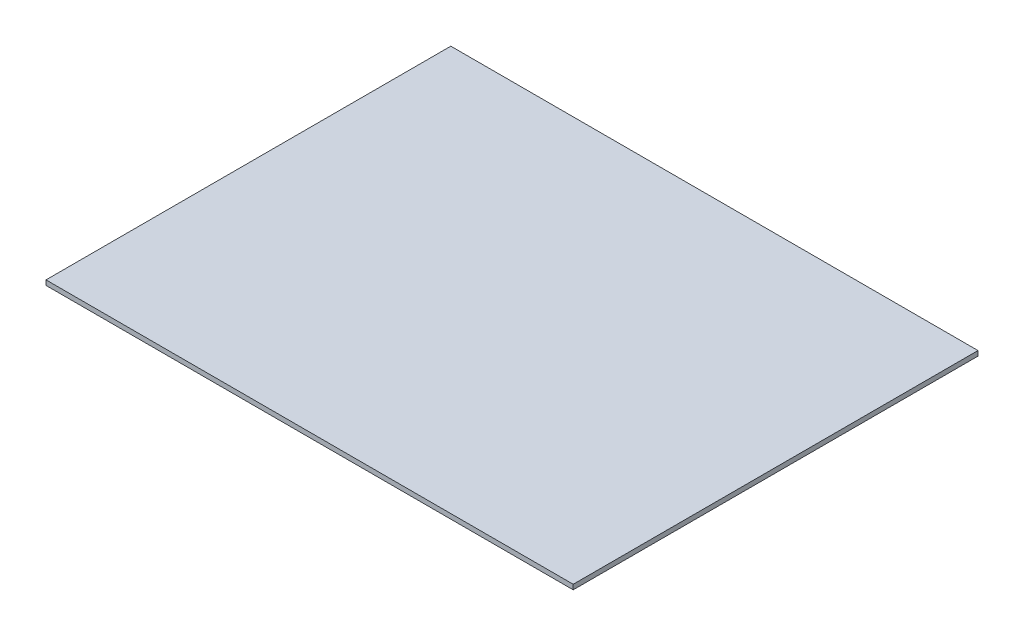
ISO-10303-21;
HEADER;
FILE_DESCRIPTION(('STEP AP214'),'2;1');
FILE_NAME('part.step','',(''),(''),'','','');
FILE_SCHEMA(('AUTOMOTIVE_DESIGN { 1 0 10303 214 1 1 1 1 }'));
ENDSEC;
DATA;
#1=APPLICATION_CONTEXT('core data for automotive mechanical design processes');
#2=APPLICATION_PROTOCOL_DEFINITION('international standard','automotive_design',2000,#1);
#3=PRODUCT_CONTEXT('',#1,'mechanical');
#4=PRODUCT('Part','Part','',(#3));
#5=PRODUCT_RELATED_PRODUCT_CATEGORY('part','',(#4));
#6=PRODUCT_DEFINITION_FORMATION('','',#4);
#7=PRODUCT_DEFINITION_CONTEXT('part definition',#1,'design');
#8=PRODUCT_DEFINITION('design','',#6,#7);
#9=PRODUCT_DEFINITION_SHAPE('','',#8);
#10=(LENGTH_UNIT() NAMED_UNIT(*) SI_UNIT(.MILLI.,.METRE.));
#11=(NAMED_UNIT(*) PLANE_ANGLE_UNIT() SI_UNIT($,.RADIAN.));
#12=(NAMED_UNIT(*) SI_UNIT($,.STERADIAN.) SOLID_ANGLE_UNIT());
#13=UNCERTAINTY_MEASURE_WITH_UNIT(LENGTH_MEASURE(1.E-05),#10,'distance_accuracy_value','');
#14=(GEOMETRIC_REPRESENTATION_CONTEXT(3) GLOBAL_UNCERTAINTY_ASSIGNED_CONTEXT((#13)) GLOBAL_UNIT_ASSIGNED_CONTEXT((#10,
#11,#12)) REPRESENTATION_CONTEXT('',''));
#15=CARTESIAN_POINT('',(0.,0.,0.));
#16=DIRECTION('',(0.,0.,1.));
#17=DIRECTION('',(1.,0.,0.));
#18=AXIS2_PLACEMENT_3D('',#15,#16,#17);
#19=CARTESIAN_POINT('',(217.5,4.,167.));
#20=DIRECTION('',(-1.,0.,0.));
#21=DIRECTION('',(0.,0.,1.));
#22=AXIS2_PLACEMENT_3D('',#19,#20,#21);
#23=PLANE('',#22);
#24=DIRECTION('',(0.,0.,-1.));
#25=VECTOR('',#24,1.);
#26=CARTESIAN_POINT('',(217.5,0.,167.));
#27=LINE('',#26,#25);
#28=CARTESIAN_POINT('',(217.5,0.,167.));
#29=VERTEX_POINT('',#28);
#30=CARTESIAN_POINT('',(217.5,0.,-167.));
#31=VERTEX_POINT('',#30);
#32=EDGE_CURVE('E97',#29,#31,#27,.T.);
#33=ORIENTED_EDGE('',*,*,#32,.T.);
#34=DIRECTION('',(0.,-1.,0.));
#35=VECTOR('',#34,1.);
#36=CARTESIAN_POINT('',(217.5,4.,-167.));
#37=LINE('',#36,#35);
#38=CARTESIAN_POINT('',(217.5,4.,-167.));
#39=VERTEX_POINT('',#38);
#40=EDGE_CURVE('E11',#39,#31,#37,.T.);
#41=ORIENTED_EDGE('',*,*,#40,.F.);
#42=DIRECTION('',(0.,0.,-1.));
#43=VECTOR('',#42,1.);
#44=CARTESIAN_POINT('',(217.5,4.,167.));
#45=LINE('',#44,#43);
#46=CARTESIAN_POINT('',(217.5,4.,167.));
#47=VERTEX_POINT('',#46);
#48=EDGE_CURVE('E85',#47,#39,#45,.T.);
#49=ORIENTED_EDGE('',*,*,#48,.F.);
#50=DIRECTION('',(0.,-1.,0.));
#51=VECTOR('',#50,1.);
#52=CARTESIAN_POINT('',(217.5,4.,167.));
#53=LINE('',#52,#51);
#54=EDGE_CURVE('E93',#47,#29,#53,.T.);
#55=ORIENTED_EDGE('',*,*,#54,.T.);
#56=EDGE_LOOP('',(#33,#41,#49,#55));
#57=FACE_BOUND('',#56,.T.);
#58=ADVANCED_FACE('F34',(#57),#23,.F.);
#59=CARTESIAN_POINT('',(-217.5,4.,-167.));
#60=DIRECTION('',(0.,0.,1.));
#61=DIRECTION('',(1.,0.,0.));
#62=AXIS2_PLACEMENT_3D('',#59,#60,#61);
#63=PLANE('',#62);
#64=DIRECTION('',(-1.,0.,0.));
#65=VECTOR('',#64,1.);
#66=CARTESIAN_POINT('',(-217.5,0.,-167.));
#67=LINE('',#66,#65);
#68=CARTESIAN_POINT('',(-217.5,0.,-167.));
#69=VERTEX_POINT('',#68);
#70=EDGE_CURVE('E89',#31,#69,#67,.T.);
#71=ORIENTED_EDGE('',*,*,#70,.T.);
#72=DIRECTION('',(0.,-1.,0.));
#73=VECTOR('',#72,1.);
#74=CARTESIAN_POINT('',(-217.5,4.,-167.));
#75=LINE('',#74,#73);
#76=CARTESIAN_POINT('',(-217.5,4.,-167.));
#77=VERTEX_POINT('',#76);
#78=EDGE_CURVE('E42',#77,#69,#75,.T.);
#79=ORIENTED_EDGE('',*,*,#78,.F.);
#80=DIRECTION('',(-1.,0.,0.));
#81=VECTOR('',#80,1.);
#82=CARTESIAN_POINT('',(-217.5,4.,-167.));
#83=LINE('',#82,#81);
#84=EDGE_CURVE('E80',#39,#77,#83,.T.);
#85=ORIENTED_EDGE('',*,*,#84,.F.);
#86=ORIENTED_EDGE('',*,*,#40,.T.);
#87=EDGE_LOOP('',(#71,#79,#85,#86));
#88=FACE_BOUND('',#87,.T.);
#89=ADVANCED_FACE('F88',(#88),#63,.F.);
#90=CARTESIAN_POINT('',(-217.5,4.,167.));
#91=DIRECTION('',(1.,0.,0.));
#92=DIRECTION('',(0.,0.,-1.));
#93=AXIS2_PLACEMENT_3D('',#90,#91,#92);
#94=PLANE('',#93);
#95=DIRECTION('',(0.,0.,1.));
#96=VECTOR('',#95,1.);
#97=CARTESIAN_POINT('',(-217.5,0.,167.));
#98=LINE('',#97,#96);
#99=CARTESIAN_POINT('',(-217.5,0.,167.));
#100=VERTEX_POINT('',#99);
#101=EDGE_CURVE('E67',#69,#100,#98,.T.);
#102=ORIENTED_EDGE('',*,*,#101,.T.);
#103=DIRECTION('',(0.,-1.,0.));
#104=VECTOR('',#103,1.);
#105=CARTESIAN_POINT('',(-217.5,4.,167.));
#106=LINE('',#105,#104);
#107=CARTESIAN_POINT('',(-217.5,4.,167.));
#108=VERTEX_POINT('',#107);
#109=EDGE_CURVE('E90',#108,#100,#106,.T.);
#110=ORIENTED_EDGE('',*,*,#109,.F.);
#111=DIRECTION('',(0.,0.,1.));
#112=VECTOR('',#111,1.);
#113=CARTESIAN_POINT('',(-217.5,4.,167.));
#114=LINE('',#113,#112);
#115=EDGE_CURVE('E83',#77,#108,#114,.T.);
#116=ORIENTED_EDGE('',*,*,#115,.F.);
#117=ORIENTED_EDGE('',*,*,#78,.T.);
#118=EDGE_LOOP('',(#102,#110,#116,#117));
#119=FACE_BOUND('',#118,.T.);
#120=ADVANCED_FACE('F91',(#119),#94,.F.);
#121=CARTESIAN_POINT('',(-217.5,4.,167.));
#122=DIRECTION('',(0.,0.,-1.));
#123=DIRECTION('',(-1.,0.,0.));
#124=AXIS2_PLACEMENT_3D('',#121,#122,#123);
#125=PLANE('',#124);
#126=DIRECTION('',(1.,0.,0.));
#127=VECTOR('',#126,1.);
#128=CARTESIAN_POINT('',(-217.5,0.,167.));
#129=LINE('',#128,#127);
#130=EDGE_CURVE('E73',#100,#29,#129,.T.);
#131=ORIENTED_EDGE('',*,*,#130,.T.);
#132=ORIENTED_EDGE('',*,*,#54,.F.);
#133=DIRECTION('',(1.,0.,0.));
#134=VECTOR('',#133,1.);
#135=CARTESIAN_POINT('',(-217.5,4.,167.));
#136=LINE('',#135,#134);
#137=EDGE_CURVE('E50',#108,#47,#136,.T.);
#138=ORIENTED_EDGE('',*,*,#137,.F.);
#139=ORIENTED_EDGE('',*,*,#109,.T.);
#140=EDGE_LOOP('',(#131,#132,#138,#139));
#141=FACE_BOUND('',#140,.T.);
#142=ADVANCED_FACE('F104',(#141),#125,.F.);
#143=CARTESIAN_POINT('',(0.,4.,0.));
#144=DIRECTION('',(0.,-1.,0.));
#145=DIRECTION('',(0.,0.,-1.));
#146=AXIS2_PLACEMENT_3D('',#143,#144,#145);
#147=PLANE('',#146);
#148=ORIENTED_EDGE('',*,*,#48,.T.);
#149=ORIENTED_EDGE('',*,*,#84,.T.);
#150=ORIENTED_EDGE('',*,*,#115,.T.);
#151=ORIENTED_EDGE('',*,*,#137,.T.);
#152=EDGE_LOOP('',(#148,#149,#150,#151));
#153=FACE_BOUND('',#152,.T.);
#154=ADVANCED_FACE('F81',(#153),#147,.F.);
#155=CARTESIAN_POINT('',(0.,0.,0.));
#156=DIRECTION('',(0.,-1.,0.));
#157=DIRECTION('',(0.,0.,-1.));
#158=AXIS2_PLACEMENT_3D('',#155,#156,#157);
#159=PLANE('',#158);
#160=ORIENTED_EDGE('',*,*,#32,.F.);
#161=ORIENTED_EDGE('',*,*,#130,.F.);
#162=ORIENTED_EDGE('',*,*,#101,.F.);
#163=ORIENTED_EDGE('',*,*,#70,.F.);
#164=EDGE_LOOP('',(#160,#161,#162,#163));
#165=FACE_BOUND('',#164,.T.);
#166=ADVANCED_FACE('F107',(#165),#159,.T.);
#167=CLOSED_SHELL('',(#58,#89,#120,#142,#154,#166));
#168=MANIFOLD_SOLID_BREP('B2',#167);
#169=ADVANCED_BREP_SHAPE_REPRESENTATION('',(#18,#168),#14);
#170=SHAPE_DEFINITION_REPRESENTATION(#9,#169);
ENDSEC;
END-ISO-10303-21;
